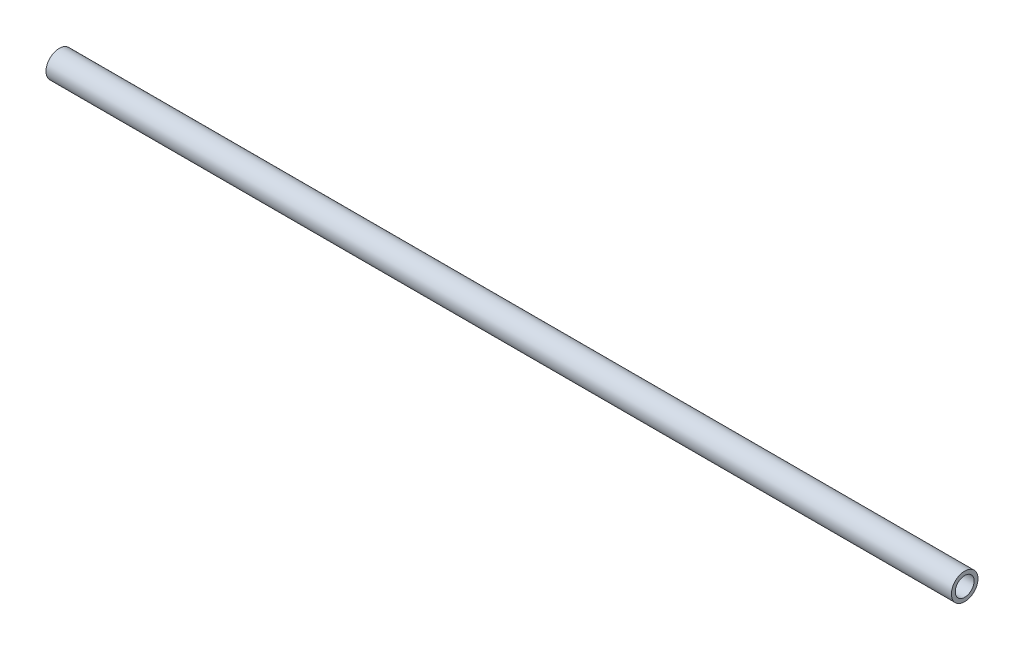
ISO-10303-21;
HEADER;
FILE_DESCRIPTION(('STEP AP214'),'2;1');
FILE_NAME('part.step','',(''),(''),'','','');
FILE_SCHEMA(('AUTOMOTIVE_DESIGN { 1 0 10303 214 1 1 1 1 }'));
ENDSEC;
DATA;
#1=APPLICATION_CONTEXT('core data for automotive mechanical design processes');
#2=APPLICATION_PROTOCOL_DEFINITION('international standard','automotive_design',2000,#1);
#3=PRODUCT_CONTEXT('',#1,'mechanical');
#4=PRODUCT('Part','Part','',(#3));
#5=PRODUCT_RELATED_PRODUCT_CATEGORY('part','',(#4));
#6=PRODUCT_DEFINITION_FORMATION('','',#4);
#7=PRODUCT_DEFINITION_CONTEXT('part definition',#1,'design');
#8=PRODUCT_DEFINITION('design','',#6,#7);
#9=PRODUCT_DEFINITION_SHAPE('','',#8);
#10=(LENGTH_UNIT() NAMED_UNIT(*) SI_UNIT(.MILLI.,.METRE.));
#11=(NAMED_UNIT(*) PLANE_ANGLE_UNIT() SI_UNIT($,.RADIAN.));
#12=(NAMED_UNIT(*) SI_UNIT($,.STERADIAN.) SOLID_ANGLE_UNIT());
#13=UNCERTAINTY_MEASURE_WITH_UNIT(LENGTH_MEASURE(1.E-05),#10,'distance_accuracy_value','');
#14=(GEOMETRIC_REPRESENTATION_CONTEXT(3) GLOBAL_UNCERTAINTY_ASSIGNED_CONTEXT((#13)) GLOBAL_UNIT_ASSIGNED_CONTEXT((#10,
#11,#12)) REPRESENTATION_CONTEXT('',''));
#15=CARTESIAN_POINT('',(0.,0.,0.));
#16=DIRECTION('',(0.,0.,1.));
#17=DIRECTION('',(1.,0.,0.));
#18=AXIS2_PLACEMENT_3D('',#15,#16,#17);
#19=CARTESIAN_POINT('',(-304.8,0.,0.));
#20=DIRECTION('',(1.,0.,0.));
#21=DIRECTION('',(0.,0.,-1.));
#22=AXIS2_PLACEMENT_3D('',#19,#20,#21);
#23=CYLINDRICAL_SURFACE('',#22,8.9535);
#24=CARTESIAN_POINT('',(-304.8,0.,0.));
#25=DIRECTION('',(1.,0.,0.));
#26=DIRECTION('',(0.,0.,-1.));
#27=AXIS2_PLACEMENT_3D('',#24,#25,#26);
#28=CIRCLE('',#27,8.9535);
#29=CARTESIAN_POINT('',(-304.8,0.,-8.9535));
#30=VERTEX_POINT('',#29);
#31=EDGE_CURVE('E10',#30,#30,#28,.T.);
#32=ORIENTED_EDGE('',*,*,#31,.T.);
#33=EDGE_LOOP('',(#32));
#34=FACE_BOUND('',#33,.T.);
#35=CARTESIAN_POINT('',(304.8,0.,0.));
#36=DIRECTION('',(1.,0.,0.));
#37=DIRECTION('',(0.,0.,-1.));
#38=AXIS2_PLACEMENT_3D('',#35,#36,#37);
#39=CIRCLE('',#38,8.9535);
#40=CARTESIAN_POINT('',(304.8,0.,-8.9535));
#41=VERTEX_POINT('',#40);
#42=EDGE_CURVE('E40',#41,#41,#39,.T.);
#43=ORIENTED_EDGE('',*,*,#42,.F.);
#44=EDGE_LOOP('',(#43));
#45=FACE_BOUND('',#44,.T.);
#46=ADVANCED_FACE('F30',(#34,#45),#23,.T.);
#47=CARTESIAN_POINT('',(-304.8,0.,0.));
#48=DIRECTION('',(1.,0.,0.));
#49=DIRECTION('',(0.,0.,-1.));
#50=AXIS2_PLACEMENT_3D('',#47,#48,#49);
#51=PLANE('',#50);
#52=CARTESIAN_POINT('',(-304.8,0.,0.));
#53=DIRECTION('',(1.,0.,0.));
#54=DIRECTION('',(0.,0.,-1.));
#55=AXIS2_PLACEMENT_3D('',#52,#53,#54);
#56=CIRCLE('',#55,6.35);
#57=CARTESIAN_POINT('',(-304.8,0.,-6.35));
#58=VERTEX_POINT('',#57);
#59=EDGE_CURVE('E36',#58,#58,#56,.T.);
#60=ORIENTED_EDGE('',*,*,#59,.T.);
#61=EDGE_LOOP('',(#60));
#62=FACE_BOUND('',#61,.T.);
#63=ORIENTED_EDGE('',*,*,#31,.F.);
#64=EDGE_LOOP('',(#63));
#65=FACE_BOUND('',#64,.T.);
#66=ADVANCED_FACE('F59',(#62,#65),#51,.F.);
#67=CARTESIAN_POINT('',(-304.8,0.,0.));
#68=DIRECTION('',(1.,0.,0.));
#69=DIRECTION('',(0.,0.,-1.));
#70=AXIS2_PLACEMENT_3D('',#67,#68,#69);
#71=CYLINDRICAL_SURFACE('',#70,6.35);
#72=ORIENTED_EDGE('',*,*,#59,.F.);
#73=EDGE_LOOP('',(#72));
#74=FACE_BOUND('',#73,.T.);
#75=CARTESIAN_POINT('',(304.8,0.,0.));
#76=DIRECTION('',(1.,0.,0.));
#77=DIRECTION('',(0.,0.,-1.));
#78=AXIS2_PLACEMENT_3D('',#75,#76,#77);
#79=CIRCLE('',#78,6.35);
#80=CARTESIAN_POINT('',(304.8,0.,-6.35));
#81=VERTEX_POINT('',#80);
#82=EDGE_CURVE('E44',#81,#81,#79,.T.);
#83=ORIENTED_EDGE('',*,*,#82,.T.);
#84=EDGE_LOOP('',(#83));
#85=FACE_BOUND('',#84,.T.);
#86=ADVANCED_FACE('F50',(#74,#85),#71,.F.);
#87=CARTESIAN_POINT('',(304.8,0.,0.));
#88=DIRECTION('',(1.,0.,0.));
#89=DIRECTION('',(0.,0.,-1.));
#90=AXIS2_PLACEMENT_3D('',#87,#88,#89);
#91=PLANE('',#90);
#92=ORIENTED_EDGE('',*,*,#42,.T.);
#93=EDGE_LOOP('',(#92));
#94=FACE_BOUND('',#93,.T.);
#95=ORIENTED_EDGE('',*,*,#82,.F.);
#96=EDGE_LOOP('',(#95));
#97=FACE_BOUND('',#96,.T.);
#98=ADVANCED_FACE('F52',(#94,#97),#91,.T.);
#99=CLOSED_SHELL('',(#46,#66,#86,#98));
#100=MANIFOLD_SOLID_BREP('B2',#99);
#101=ADVANCED_BREP_SHAPE_REPRESENTATION('',(#18,#100),#14);
#102=SHAPE_DEFINITION_REPRESENTATION(#9,#101);
ENDSEC;
END-ISO-10303-21;
